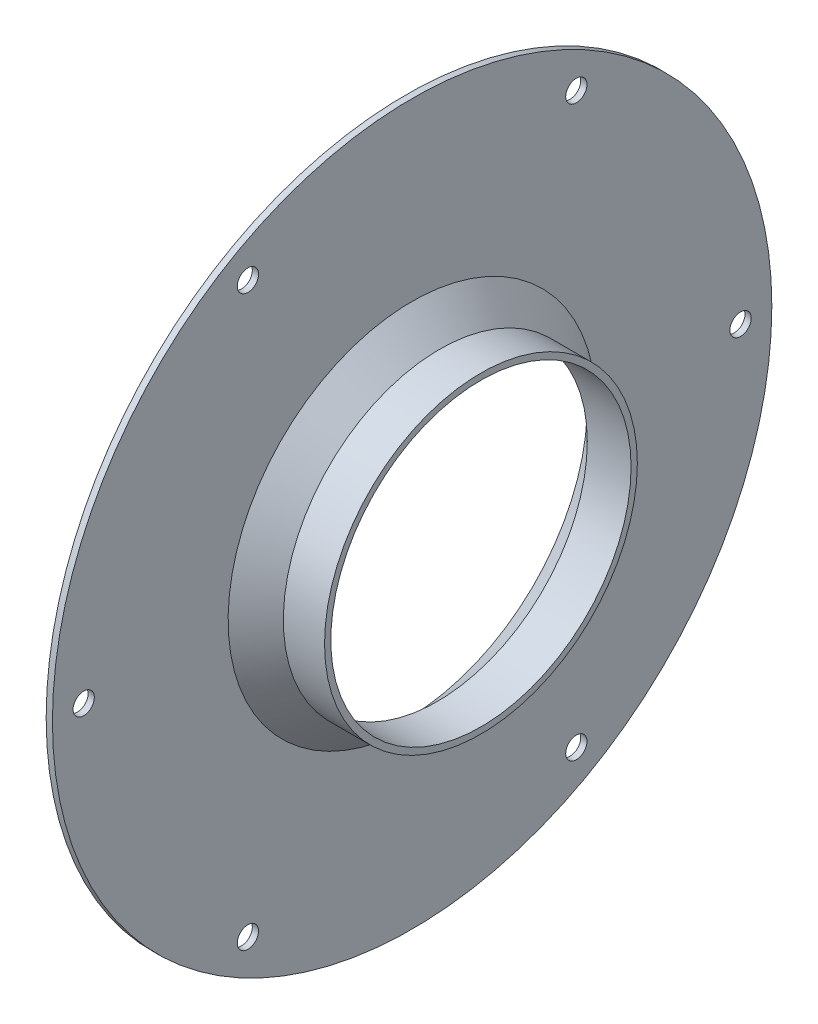
ISO-10303-21;
HEADER;
FILE_DESCRIPTION(('STEP AP214'),'2;1');
FILE_NAME('part.step','',(''),(''),'','','');
FILE_SCHEMA(('AUTOMOTIVE_DESIGN { 1 0 10303 214 1 1 1 1 }'));
ENDSEC;
DATA;
#1=APPLICATION_CONTEXT('core data for automotive mechanical design processes');
#2=APPLICATION_PROTOCOL_DEFINITION('international standard','automotive_design',2000,#1);
#3=PRODUCT_CONTEXT('',#1,'mechanical');
#4=PRODUCT('Part','Part','',(#3));
#5=PRODUCT_RELATED_PRODUCT_CATEGORY('part','',(#4));
#6=PRODUCT_DEFINITION_FORMATION('','',#4);
#7=PRODUCT_DEFINITION_CONTEXT('part definition',#1,'design');
#8=PRODUCT_DEFINITION('design','',#6,#7);
#9=PRODUCT_DEFINITION_SHAPE('','',#8);
#10=(LENGTH_UNIT() NAMED_UNIT(*) SI_UNIT(.MILLI.,.METRE.));
#11=(NAMED_UNIT(*) PLANE_ANGLE_UNIT() SI_UNIT($,.RADIAN.));
#12=(NAMED_UNIT(*) SI_UNIT($,.STERADIAN.) SOLID_ANGLE_UNIT());
#13=UNCERTAINTY_MEASURE_WITH_UNIT(LENGTH_MEASURE(1.E-05),#10,'distance_accuracy_value','');
#14=(GEOMETRIC_REPRESENTATION_CONTEXT(3) GLOBAL_UNCERTAINTY_ASSIGNED_CONTEXT((#13)) GLOBAL_UNIT_ASSIGNED_CONTEXT((#10,
#11,#12)) REPRESENTATION_CONTEXT('',''));
#15=CARTESIAN_POINT('',(0.,0.,0.));
#16=DIRECTION('',(0.,0.,1.));
#17=DIRECTION('',(1.,0.,0.));
#18=AXIS2_PLACEMENT_3D('',#15,#16,#17);
#19=CARTESIAN_POINT('',(27.8748528884,0.,0.));
#20=DIRECTION('',(1.,0.,0.));
#21=DIRECTION('',(0.,0.,-1.));
#22=AXIS2_PLACEMENT_3D('',#19,#20,#21);
#23=CYLINDRICAL_SURFACE('',#22,25.);
#24=CARTESIAN_POINT('',(33.8890664507753,0.,0.));
#25=DIRECTION('',(-1.,0.,0.));
#26=DIRECTION('',(0.,0.,-1.));
#27=AXIS2_PLACEMENT_3D('',#24,#25,#26);
#28=CIRCLE('',#27,25.0000000000053);
#29=CARTESIAN_POINT('',(33.8890664507753,0.,-25.0000000000053));
#30=VERTEX_POINT('',#29);
#31=EDGE_CURVE('E30',#30,#30,#28,.T.);
#32=ORIENTED_EDGE('',*,*,#31,.F.);
#33=EDGE_LOOP('',(#32));
#34=FACE_BOUND('',#33,.T.);
#35=CARTESIAN_POINT('',(40.4748528884,0.,0.));
#36=DIRECTION('',(1.,0.,0.));
#37=DIRECTION('',(0.,0.,-1.));
#38=AXIS2_PLACEMENT_3D('',#35,#36,#37);
#39=CIRCLE('',#38,25.);
#40=CARTESIAN_POINT('',(40.4748528884,0.,-25.));
#41=VERTEX_POINT('',#40);
#42=EDGE_CURVE('E18',#41,#41,#39,.T.);
#43=ORIENTED_EDGE('',*,*,#42,.F.);
#44=EDGE_LOOP('',(#43));
#45=FACE_BOUND('',#44,.T.);
#46=ADVANCED_FACE('F15',(#34,#45),#23,.T.);
#47=CARTESIAN_POINT('',(40.4748528884,0.,0.));
#48=DIRECTION('',(1.,0.,0.));
#49=DIRECTION('',(0.,0.,-1.));
#50=AXIS2_PLACEMENT_3D('',#47,#48,#49);
#51=PLANE('',#50);
#52=CARTESIAN_POINT('',(40.4748528884,0.,0.));
#53=DIRECTION('',(1.,0.,0.));
#54=DIRECTION('',(0.,0.,-1.));
#55=AXIS2_PLACEMENT_3D('',#52,#53,#54);
#56=CIRCLE('',#55,24.);
#57=CARTESIAN_POINT('',(40.4748528884,0.,-24.));
#58=VERTEX_POINT('',#57);
#59=EDGE_CURVE('E74',#58,#58,#56,.F.);
#60=ORIENTED_EDGE('',*,*,#59,.T.);
#61=EDGE_LOOP('',(#60));
#62=FACE_BOUND('',#61,.T.);
#63=ORIENTED_EDGE('',*,*,#42,.T.);
#64=EDGE_LOOP('',(#63));
#65=FACE_BOUND('',#64,.T.);
#66=ADVANCED_FACE('F84',(#62,#65),#51,.T.);
#67=CARTESIAN_POINT('',(29.4748528884047,0.,0.));
#68=DIRECTION('',(-1.,0.,0.));
#69=DIRECTION('',(0.,-1.,0.));
#70=AXIS2_PLACEMENT_3D('',#67,#68,#69);
#71=CONICAL_SURFACE('',#70,29.4142135623747,0.7853981633973);
#72=CARTESIAN_POINT('',(29.4748528884047,0.,0.));
#73=DIRECTION('',(-1.,0.,0.));
#74=DIRECTION('',(0.,-1.,0.));
#75=AXIS2_PLACEMENT_3D('',#72,#73,#74);
#76=CIRCLE('',#75,29.4142135623747);
#77=CARTESIAN_POINT('',(29.4748528884047,-29.4142135623747,0.));
#78=VERTEX_POINT('',#77);
#79=EDGE_CURVE('E72',#78,#78,#76,.T.);
#80=ORIENTED_EDGE('',*,*,#79,.F.);
#81=EDGE_LOOP('',(#80));
#82=FACE_BOUND('',#81,.T.);
#83=ORIENTED_EDGE('',*,*,#31,.T.);
#84=EDGE_LOOP('',(#83));
#85=FACE_BOUND('',#84,.T.);
#86=ADVANCED_FACE('F92',(#82,#85),#71,.T.);
#87=CARTESIAN_POINT('',(27.8748528884,0.,0.));
#88=DIRECTION('',(1.,0.,0.));
#89=DIRECTION('',(0.,0.,-1.));
#90=AXIS2_PLACEMENT_3D('',#87,#88,#89);
#91=CYLINDRICAL_SURFACE('',#90,24.);
#92=ORIENTED_EDGE('',*,*,#59,.F.);
#93=EDGE_LOOP('',(#92));
#94=FACE_BOUND('',#93,.T.);
#95=CARTESIAN_POINT('',(33.4748528884004,0.,0.));
#96=DIRECTION('',(-1.,0.,0.));
#97=DIRECTION('',(0.,0.,-1.));
#98=AXIS2_PLACEMENT_3D('',#95,#96,#97);
#99=CIRCLE('',#98,24.0000000000004);
#100=CARTESIAN_POINT('',(33.4748528884004,0.,-24.0000000000004));
#101=VERTEX_POINT('',#100);
#102=EDGE_CURVE('E53',#101,#101,#99,.T.);
#103=ORIENTED_EDGE('',*,*,#102,.T.);
#104=EDGE_LOOP('',(#103));
#105=FACE_BOUND('',#104,.T.);
#106=ADVANCED_FACE('F136',(#94,#105),#91,.F.);
#107=CARTESIAN_POINT('',(29.4748528884,0.,0.));
#108=DIRECTION('',(1.,0.,0.));
#109=DIRECTION('',(0.,0.,-1.));
#110=AXIS2_PLACEMENT_3D('',#107,#108,#109);
#111=PLANE('',#110);
#112=CARTESIAN_POINT('',(29.4748528884,45.46633369868,-26.25));
#113=DIRECTION('',(-1.,0.,0.));
#114=DIRECTION('',(0.,0.,1.));
#115=AXIS2_PLACEMENT_3D('',#112,#113,#114);
#116=CIRCLE('',#115,1.7);
#117=CARTESIAN_POINT('',(29.4748528884,45.46633369868,-24.55));
#118=VERTEX_POINT('',#117);
#119=EDGE_CURVE('E50',#118,#118,#116,.T.);
#120=ORIENTED_EDGE('',*,*,#119,.T.);
#121=EDGE_LOOP('',(#120));
#122=FACE_BOUND('',#121,.T.);
#123=ORIENTED_EDGE('',*,*,#79,.T.);
#124=EDGE_LOOP('',(#123));
#125=FACE_BOUND('',#124,.T.);
#126=CARTESIAN_POINT('',(29.4748528884,45.46633369868,26.25));
#127=DIRECTION('',(-1.,0.,0.));
#128=DIRECTION('',(0.,0.,1.));
#129=AXIS2_PLACEMENT_3D('',#126,#127,#128);
#130=CIRCLE('',#129,1.7);
#131=CARTESIAN_POINT('',(29.4748528884,45.46633369868,27.95));
#132=VERTEX_POINT('',#131);
#133=EDGE_CURVE('E54',#132,#132,#130,.T.);
#134=ORIENTED_EDGE('',*,*,#133,.T.);
#135=EDGE_LOOP('',(#134));
#136=FACE_BOUND('',#135,.T.);
#137=CARTESIAN_POINT('',(29.4748528884,0.,52.5));
#138=DIRECTION('',(-1.,0.,0.));
#139=DIRECTION('',(0.,0.,1.));
#140=AXIS2_PLACEMENT_3D('',#137,#138,#139);
#141=CIRCLE('',#140,1.7);
#142=CARTESIAN_POINT('',(29.4748528884,0.,54.2));
#143=VERTEX_POINT('',#142);
#144=EDGE_CURVE('E57',#143,#143,#141,.T.);
#145=ORIENTED_EDGE('',*,*,#144,.T.);
#146=EDGE_LOOP('',(#145));
#147=FACE_BOUND('',#146,.T.);
#148=CARTESIAN_POINT('',(29.4748528884,-45.46633369868,26.25));
#149=DIRECTION('',(-1.,0.,0.));
#150=DIRECTION('',(0.,0.,1.));
#151=AXIS2_PLACEMENT_3D('',#148,#149,#150);
#152=CIRCLE('',#151,1.7);
#153=CARTESIAN_POINT('',(29.4748528884,-45.46633369868,27.95));
#154=VERTEX_POINT('',#153);
#155=EDGE_CURVE('E60',#154,#154,#152,.T.);
#156=ORIENTED_EDGE('',*,*,#155,.T.);
#157=EDGE_LOOP('',(#156));
#158=FACE_BOUND('',#157,.T.);
#159=CARTESIAN_POINT('',(29.4748528884,-45.46633369868,-26.25));
#160=DIRECTION('',(-1.,0.,0.));
#161=DIRECTION('',(0.,0.,1.));
#162=AXIS2_PLACEMENT_3D('',#159,#160,#161);
#163=CIRCLE('',#162,1.7);
#164=CARTESIAN_POINT('',(29.4748528884,-45.46633369868,-24.55));
#165=VERTEX_POINT('',#164);
#166=EDGE_CURVE('E63',#165,#165,#163,.T.);
#167=ORIENTED_EDGE('',*,*,#166,.T.);
#168=EDGE_LOOP('',(#167));
#169=FACE_BOUND('',#168,.T.);
#170=CARTESIAN_POINT('',(29.4748528884,0.,-52.5));
#171=DIRECTION('',(-1.,0.,0.));
#172=DIRECTION('',(0.,0.,1.));
#173=AXIS2_PLACEMENT_3D('',#170,#171,#172);
#174=CIRCLE('',#173,1.7);
#175=CARTESIAN_POINT('',(29.4748528884,0.,-50.8));
#176=VERTEX_POINT('',#175);
#177=EDGE_CURVE('E66',#176,#176,#174,.T.);
#178=ORIENTED_EDGE('',*,*,#177,.T.);
#179=EDGE_LOOP('',(#178));
#180=FACE_BOUND('',#179,.T.);
#181=CARTESIAN_POINT('',(29.4748528884,0.,0.));
#182=DIRECTION('',(1.,0.,0.));
#183=DIRECTION('',(0.,0.,-1.));
#184=AXIS2_PLACEMENT_3D('',#181,#182,#183);
#185=CIRCLE('',#184,57.5);
#186=CARTESIAN_POINT('',(29.4748528884,0.,-57.5));
#187=VERTEX_POINT('',#186);
#188=EDGE_CURVE('E69',#187,#187,#185,.F.);
#189=ORIENTED_EDGE('',*,*,#188,.F.);
#190=EDGE_LOOP('',(#189));
#191=FACE_BOUND('',#190,.T.);
#192=ADVANCED_FACE('F132',(#122,#125,#136,#147,#158,#169,#180,#191),#111,.T.);
#193=CARTESIAN_POINT('',(27.8748528884,0.,0.));
#194=DIRECTION('',(1.,0.,0.));
#195=DIRECTION('',(0.,0.,-1.));
#196=AXIS2_PLACEMENT_3D('',#193,#194,#195);
#197=CYLINDRICAL_SURFACE('',#196,57.5);
#198=ORIENTED_EDGE('',*,*,#188,.T.);
#199=EDGE_LOOP('',(#198));
#200=FACE_BOUND('',#199,.T.);
#201=CARTESIAN_POINT('',(28.4748528884,0.,0.));
#202=DIRECTION('',(1.,0.,0.));
#203=DIRECTION('',(0.,0.,-1.));
#204=AXIS2_PLACEMENT_3D('',#201,#202,#203);
#205=CIRCLE('',#204,57.5);
#206=CARTESIAN_POINT('',(28.4748528884,0.,-57.5));
#207=VERTEX_POINT('',#206);
#208=EDGE_CURVE('E47',#207,#207,#205,.T.);
#209=ORIENTED_EDGE('',*,*,#208,.T.);
#210=EDGE_LOOP('',(#209));
#211=FACE_BOUND('',#210,.T.);
#212=ADVANCED_FACE('F128',(#200,#211),#197,.T.);
#213=CARTESIAN_POINT('',(29.4748528884,0.,-52.5));
#214=DIRECTION('',(-1.,0.,0.));
#215=DIRECTION('',(0.,0.,1.));
#216=AXIS2_PLACEMENT_3D('',#213,#214,#215);
#217=CYLINDRICAL_SURFACE('',#216,1.7);
#218=ORIENTED_EDGE('',*,*,#177,.F.);
#219=EDGE_LOOP('',(#218));
#220=FACE_BOUND('',#219,.T.);
#221=CARTESIAN_POINT('',(28.4748528884,0.,-52.5));
#222=DIRECTION('',(-1.,0.,0.));
#223=DIRECTION('',(0.,0.,1.));
#224=AXIS2_PLACEMENT_3D('',#221,#222,#223);
#225=CIRCLE('',#224,1.7);
#226=CARTESIAN_POINT('',(28.4748528884,0.,-50.8));
#227=VERTEX_POINT('',#226);
#228=EDGE_CURVE('E44',#227,#227,#225,.T.);
#229=ORIENTED_EDGE('',*,*,#228,.T.);
#230=EDGE_LOOP('',(#229));
#231=FACE_BOUND('',#230,.T.);
#232=ADVANCED_FACE('F124',(#220,#231),#217,.F.);
#233=CARTESIAN_POINT('',(29.4748528884,-45.46633369868,-26.25));
#234=DIRECTION('',(-1.,0.,0.));
#235=DIRECTION('',(0.,0.,1.));
#236=AXIS2_PLACEMENT_3D('',#233,#234,#235);
#237=CYLINDRICAL_SURFACE('',#236,1.7);
#238=ORIENTED_EDGE('',*,*,#166,.F.);
#239=EDGE_LOOP('',(#238));
#240=FACE_BOUND('',#239,.T.);
#241=CARTESIAN_POINT('',(28.4748528884,-45.46633369868,-26.25));
#242=DIRECTION('',(-1.,0.,0.));
#243=DIRECTION('',(0.,0.,1.));
#244=AXIS2_PLACEMENT_3D('',#241,#242,#243);
#245=CIRCLE('',#244,1.7);
#246=CARTESIAN_POINT('',(28.4748528884,-45.46633369868,-24.55));
#247=VERTEX_POINT('',#246);
#248=EDGE_CURVE('E41',#247,#247,#245,.T.);
#249=ORIENTED_EDGE('',*,*,#248,.T.);
#250=EDGE_LOOP('',(#249));
#251=FACE_BOUND('',#250,.T.);
#252=ADVANCED_FACE('F120',(#240,#251),#237,.F.);
#253=CARTESIAN_POINT('',(29.4748528884,-45.46633369868,26.25));
#254=DIRECTION('',(-1.,0.,0.));
#255=DIRECTION('',(0.,0.,1.));
#256=AXIS2_PLACEMENT_3D('',#253,#254,#255);
#257=CYLINDRICAL_SURFACE('',#256,1.7);
#258=ORIENTED_EDGE('',*,*,#155,.F.);
#259=EDGE_LOOP('',(#258));
#260=FACE_BOUND('',#259,.T.);
#261=CARTESIAN_POINT('',(28.4748528884,-45.46633369868,26.25));
#262=DIRECTION('',(-1.,0.,0.));
#263=DIRECTION('',(0.,0.,1.));
#264=AXIS2_PLACEMENT_3D('',#261,#262,#263);
#265=CIRCLE('',#264,1.7);
#266=CARTESIAN_POINT('',(28.4748528884,-45.46633369868,27.95));
#267=VERTEX_POINT('',#266);
#268=EDGE_CURVE('E38',#267,#267,#265,.T.);
#269=ORIENTED_EDGE('',*,*,#268,.T.);
#270=EDGE_LOOP('',(#269));
#271=FACE_BOUND('',#270,.T.);
#272=ADVANCED_FACE('F116',(#260,#271),#257,.F.);
#273=CARTESIAN_POINT('',(29.4748528884,0.,52.5));
#274=DIRECTION('',(-1.,0.,0.));
#275=DIRECTION('',(0.,0.,1.));
#276=AXIS2_PLACEMENT_3D('',#273,#274,#275);
#277=CYLINDRICAL_SURFACE('',#276,1.7);
#278=ORIENTED_EDGE('',*,*,#144,.F.);
#279=EDGE_LOOP('',(#278));
#280=FACE_BOUND('',#279,.T.);
#281=CARTESIAN_POINT('',(28.4748528884,0.,52.5));
#282=DIRECTION('',(-1.,0.,0.));
#283=DIRECTION('',(0.,0.,1.));
#284=AXIS2_PLACEMENT_3D('',#281,#282,#283);
#285=CIRCLE('',#284,1.7);
#286=CARTESIAN_POINT('',(28.4748528884,0.,54.2));
#287=VERTEX_POINT('',#286);
#288=EDGE_CURVE('E35',#287,#287,#285,.T.);
#289=ORIENTED_EDGE('',*,*,#288,.T.);
#290=EDGE_LOOP('',(#289));
#291=FACE_BOUND('',#290,.T.);
#292=ADVANCED_FACE('F112',(#280,#291),#277,.F.);
#293=CARTESIAN_POINT('',(29.4748528884,45.46633369868,26.25));
#294=DIRECTION('',(-1.,0.,0.));
#295=DIRECTION('',(0.,0.,1.));
#296=AXIS2_PLACEMENT_3D('',#293,#294,#295);
#297=CYLINDRICAL_SURFACE('',#296,1.7);
#298=ORIENTED_EDGE('',*,*,#133,.F.);
#299=EDGE_LOOP('',(#298));
#300=FACE_BOUND('',#299,.T.);
#301=CARTESIAN_POINT('',(28.4748528884,45.46633369868,26.25));
#302=DIRECTION('',(-1.,0.,0.));
#303=DIRECTION('',(0.,0.,1.));
#304=AXIS2_PLACEMENT_3D('',#301,#302,#303);
#305=CIRCLE('',#304,1.7);
#306=CARTESIAN_POINT('',(28.4748528884,45.46633369868,27.95));
#307=VERTEX_POINT('',#306);
#308=EDGE_CURVE('E27',#307,#307,#305,.T.);
#309=ORIENTED_EDGE('',*,*,#308,.T.);
#310=EDGE_LOOP('',(#309));
#311=FACE_BOUND('',#310,.T.);
#312=ADVANCED_FACE('F108',(#300,#311),#297,.F.);
#313=CARTESIAN_POINT('',(28.4748528883996,0.,0.));
#314=DIRECTION('',(-1.,0.,0.));
#315=DIRECTION('',(0.,0.,1.));
#316=AXIS2_PLACEMENT_3D('',#313,#314,#315);
#317=CONICAL_SURFACE('',#316,28.9999999999996,0.7853981633973);
#318=ORIENTED_EDGE('',*,*,#102,.F.);
#319=EDGE_LOOP('',(#318));
#320=FACE_BOUND('',#319,.T.);
#321=CARTESIAN_POINT('',(28.4748528883996,0.,0.));
#322=DIRECTION('',(-1.,0.,0.));
#323=DIRECTION('',(0.,0.,1.));
#324=AXIS2_PLACEMENT_3D('',#321,#322,#323);
#325=CIRCLE('',#324,28.9999999999996);
#326=CARTESIAN_POINT('',(28.4748528883996,0.,28.9999999999996));
#327=VERTEX_POINT('',#326);
#328=EDGE_CURVE('E22',#327,#327,#325,.T.);
#329=ORIENTED_EDGE('',*,*,#328,.T.);
#330=EDGE_LOOP('',(#329));
#331=FACE_BOUND('',#330,.T.);
#332=ADVANCED_FACE('F101',(#320,#331),#317,.F.);
#333=CARTESIAN_POINT('',(29.4748528884,45.46633369868,-26.25));
#334=DIRECTION('',(-1.,0.,0.));
#335=DIRECTION('',(0.,0.,1.));
#336=AXIS2_PLACEMENT_3D('',#333,#334,#335);
#337=CYLINDRICAL_SURFACE('',#336,1.7);
#338=ORIENTED_EDGE('',*,*,#119,.F.);
#339=EDGE_LOOP('',(#338));
#340=FACE_BOUND('',#339,.T.);
#341=CARTESIAN_POINT('',(28.4748528884,45.46633369868,-26.25));
#342=DIRECTION('',(-1.,0.,0.));
#343=DIRECTION('',(0.,0.,1.));
#344=AXIS2_PLACEMENT_3D('',#341,#342,#343);
#345=CIRCLE('',#344,1.7);
#346=CARTESIAN_POINT('',(28.4748528884,45.46633369868,-24.55));
#347=VERTEX_POINT('',#346);
#348=EDGE_CURVE('E10',#347,#347,#345,.T.);
#349=ORIENTED_EDGE('',*,*,#348,.T.);
#350=EDGE_LOOP('',(#349));
#351=FACE_BOUND('',#350,.T.);
#352=ADVANCED_FACE('F95',(#340,#351),#337,.F.);
#353=CARTESIAN_POINT('',(28.4748528884,0.,0.));
#354=DIRECTION('',(1.,0.,0.));
#355=DIRECTION('',(0.,0.,-1.));
#356=AXIS2_PLACEMENT_3D('',#353,#354,#355);
#357=PLANE('',#356);
#358=ORIENTED_EDGE('',*,*,#348,.F.);
#359=EDGE_LOOP('',(#358));
#360=FACE_BOUND('',#359,.T.);
#361=ORIENTED_EDGE('',*,*,#328,.F.);
#362=EDGE_LOOP('',(#361));
#363=FACE_BOUND('',#362,.T.);
#364=ORIENTED_EDGE('',*,*,#308,.F.);
#365=EDGE_LOOP('',(#364));
#366=FACE_BOUND('',#365,.T.);
#367=ORIENTED_EDGE('',*,*,#288,.F.);
#368=EDGE_LOOP('',(#367));
#369=FACE_BOUND('',#368,.T.);
#370=ORIENTED_EDGE('',*,*,#268,.F.);
#371=EDGE_LOOP('',(#370));
#372=FACE_BOUND('',#371,.T.);
#373=ORIENTED_EDGE('',*,*,#248,.F.);
#374=EDGE_LOOP('',(#373));
#375=FACE_BOUND('',#374,.T.);
#376=ORIENTED_EDGE('',*,*,#228,.F.);
#377=EDGE_LOOP('',(#376));
#378=FACE_BOUND('',#377,.T.);
#379=ORIENTED_EDGE('',*,*,#208,.F.);
#380=EDGE_LOOP('',(#379));
#381=FACE_BOUND('',#380,.T.);
#382=ADVANCED_FACE('F93',(#360,#363,#366,#369,#372,#375,#378,#381),#357,.F.);
#383=CLOSED_SHELL('',(#46,#66,#86,#106,#192,#212,#232,#252,#272,#292,#312,#332,#352,#382));
#384=MANIFOLD_SOLID_BREP('B1',#383);
#385=ADVANCED_BREP_SHAPE_REPRESENTATION('',(#18,#384),#14);
#386=SHAPE_DEFINITION_REPRESENTATION(#9,#385);
ENDSEC;
END-ISO-10303-21;
